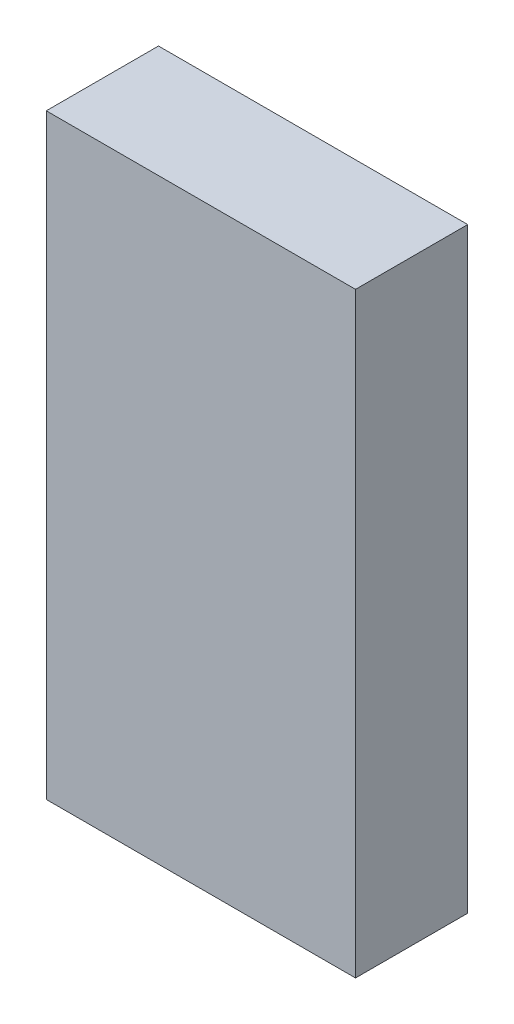
ISO-10303-21;
HEADER;
FILE_DESCRIPTION(('STEP AP214'),'2;1');
FILE_NAME('part.step','',(''),(''),'','','');
FILE_SCHEMA(('AUTOMOTIVE_DESIGN { 1 0 10303 214 1 1 1 1 }'));
ENDSEC;
DATA;
#1=APPLICATION_CONTEXT('core data for automotive mechanical design processes');
#2=APPLICATION_PROTOCOL_DEFINITION('international standard','automotive_design',2000,#1);
#3=PRODUCT_CONTEXT('',#1,'mechanical');
#4=PRODUCT('Part','Part','',(#3));
#5=PRODUCT_RELATED_PRODUCT_CATEGORY('part','',(#4));
#6=PRODUCT_DEFINITION_FORMATION('','',#4);
#7=PRODUCT_DEFINITION_CONTEXT('part definition',#1,'design');
#8=PRODUCT_DEFINITION('design','',#6,#7);
#9=PRODUCT_DEFINITION_SHAPE('','',#8);
#10=(LENGTH_UNIT() NAMED_UNIT(*) SI_UNIT(.MILLI.,.METRE.));
#11=(NAMED_UNIT(*) PLANE_ANGLE_UNIT() SI_UNIT($,.RADIAN.));
#12=(NAMED_UNIT(*) SI_UNIT($,.STERADIAN.) SOLID_ANGLE_UNIT());
#13=UNCERTAINTY_MEASURE_WITH_UNIT(LENGTH_MEASURE(1.E-05),#10,'distance_accuracy_value','');
#14=(GEOMETRIC_REPRESENTATION_CONTEXT(3) GLOBAL_UNCERTAINTY_ASSIGNED_CONTEXT((#13)) GLOBAL_UNIT_ASSIGNED_CONTEXT((#10,
#11,#12)) REPRESENTATION_CONTEXT('',''));
#15=CARTESIAN_POINT('',(0.,0.,0.));
#16=DIRECTION('',(0.,0.,1.));
#17=DIRECTION('',(1.,0.,0.));
#18=AXIS2_PLACEMENT_3D('',#15,#16,#17);
#19=CARTESIAN_POINT('',(0.3499993,0.67499992,0.));
#20=DIRECTION('',(0.,-1.,0.));
#21=DIRECTION('',(-1.,0.,0.));
#22=AXIS2_PLACEMENT_3D('',#19,#20,#21);
#23=PLANE('',#22);
#24=DIRECTION('',(-1.,0.,0.));
#25=VECTOR('',#24,1.);
#26=CARTESIAN_POINT('',(0.3499993,0.67499992,0.));
#27=LINE('',#26,#25);
#28=CARTESIAN_POINT('',(0.3499993,0.67499992,0.));
#29=VERTEX_POINT('',#28);
#30=CARTESIAN_POINT('',(-0.3499993,0.67499992,0.));
#31=VERTEX_POINT('',#30);
#32=EDGE_CURVE('E11',#29,#31,#27,.T.);
#33=ORIENTED_EDGE('',*,*,#32,.T.);
#34=DIRECTION('',(0.,0.,1.));
#35=VECTOR('',#34,1.);
#36=CARTESIAN_POINT('',(-0.3499993,0.67499992,0.));
#37=LINE('',#36,#35);
#38=CARTESIAN_POINT('',(-0.3499993,0.67499992,0.254));
#39=VERTEX_POINT('',#38);
#40=EDGE_CURVE('E24',#31,#39,#37,.T.);
#41=ORIENTED_EDGE('',*,*,#40,.T.);
#42=DIRECTION('',(-1.,0.,0.));
#43=VECTOR('',#42,1.);
#44=CARTESIAN_POINT('',(0.3499993,0.67499992,0.254));
#45=LINE('',#44,#43);
#46=CARTESIAN_POINT('',(0.3499993,0.67499992,0.254));
#47=VERTEX_POINT('',#46);
#48=EDGE_CURVE('E87',#47,#39,#45,.T.);
#49=ORIENTED_EDGE('',*,*,#48,.F.);
#50=DIRECTION('',(0.,0.,1.));
#51=VECTOR('',#50,1.);
#52=CARTESIAN_POINT('',(0.3499993,0.67499992,0.));
#53=LINE('',#52,#51);
#54=EDGE_CURVE('E36',#29,#47,#53,.T.);
#55=ORIENTED_EDGE('',*,*,#54,.F.);
#56=EDGE_LOOP('',(#33,#41,#49,#55));
#57=FACE_BOUND('',#56,.T.);
#58=ADVANCED_FACE('F17',(#57),#23,.F.);
#59=CARTESIAN_POINT('',(-0.3499993,0.67499992,0.));
#60=DIRECTION('',(1.,0.,0.));
#61=DIRECTION('',(0.,-1.,0.));
#62=AXIS2_PLACEMENT_3D('',#59,#60,#61);
#63=PLANE('',#62);
#64=DIRECTION('',(0.,-1.,0.));
#65=VECTOR('',#64,1.);
#66=CARTESIAN_POINT('',(-0.3499993,0.67499992,0.));
#67=LINE('',#66,#65);
#68=CARTESIAN_POINT('',(-0.3499993,-0.67499992,0.));
#69=VERTEX_POINT('',#68);
#70=EDGE_CURVE('E84',#31,#69,#67,.T.);
#71=ORIENTED_EDGE('',*,*,#70,.T.);
#72=DIRECTION('',(0.,0.,1.));
#73=VECTOR('',#72,1.);
#74=CARTESIAN_POINT('',(-0.3499993,-0.67499992,0.));
#75=LINE('',#74,#73);
#76=CARTESIAN_POINT('',(-0.3499993,-0.67499992,0.254));
#77=VERTEX_POINT('',#76);
#78=EDGE_CURVE('E82',#69,#77,#75,.T.);
#79=ORIENTED_EDGE('',*,*,#78,.T.);
#80=DIRECTION('',(0.,-1.,0.));
#81=VECTOR('',#80,1.);
#82=CARTESIAN_POINT('',(-0.3499993,0.67499992,0.254));
#83=LINE('',#82,#81);
#84=EDGE_CURVE('E62',#39,#77,#83,.T.);
#85=ORIENTED_EDGE('',*,*,#84,.F.);
#86=ORIENTED_EDGE('',*,*,#40,.F.);
#87=EDGE_LOOP('',(#71,#79,#85,#86));
#88=FACE_BOUND('',#87,.T.);
#89=ADVANCED_FACE('F89',(#88),#63,.F.);
#90=CARTESIAN_POINT('',(-0.3499993,-0.67499992,0.));
#91=DIRECTION('',(0.,1.,0.));
#92=DIRECTION('',(1.,0.,0.));
#93=AXIS2_PLACEMENT_3D('',#90,#91,#92);
#94=PLANE('',#93);
#95=DIRECTION('',(1.,0.,0.));
#96=VECTOR('',#95,1.);
#97=CARTESIAN_POINT('',(-0.3499993,-0.67499992,0.));
#98=LINE('',#97,#96);
#99=CARTESIAN_POINT('',(0.3499993,-0.67499992,0.));
#100=VERTEX_POINT('',#99);
#101=EDGE_CURVE('E71',#69,#100,#98,.T.);
#102=ORIENTED_EDGE('',*,*,#101,.T.);
#103=DIRECTION('',(0.,0.,1.));
#104=VECTOR('',#103,1.);
#105=CARTESIAN_POINT('',(0.3499993,-0.67499992,0.));
#106=LINE('',#105,#104);
#107=CARTESIAN_POINT('',(0.3499993,-0.67499992,0.254));
#108=VERTEX_POINT('',#107);
#109=EDGE_CURVE('E65',#100,#108,#106,.T.);
#110=ORIENTED_EDGE('',*,*,#109,.T.);
#111=DIRECTION('',(1.,0.,0.));
#112=VECTOR('',#111,1.);
#113=CARTESIAN_POINT('',(-0.3499993,-0.67499992,0.254));
#114=LINE('',#113,#112);
#115=EDGE_CURVE('E57',#77,#108,#114,.T.);
#116=ORIENTED_EDGE('',*,*,#115,.F.);
#117=ORIENTED_EDGE('',*,*,#78,.F.);
#118=EDGE_LOOP('',(#102,#110,#116,#117));
#119=FACE_BOUND('',#118,.T.);
#120=ADVANCED_FACE('F69',(#119),#94,.F.);
#121=CARTESIAN_POINT('',(0.3499993,-0.67499992,0.));
#122=DIRECTION('',(-1.,0.,0.));
#123=DIRECTION('',(0.,1.,0.));
#124=AXIS2_PLACEMENT_3D('',#121,#122,#123);
#125=PLANE('',#124);
#126=DIRECTION('',(0.,1.,0.));
#127=VECTOR('',#126,1.);
#128=CARTESIAN_POINT('',(0.3499993,-0.67499992,0.));
#129=LINE('',#128,#127);
#130=EDGE_CURVE('E66',#100,#29,#129,.T.);
#131=ORIENTED_EDGE('',*,*,#130,.T.);
#132=ORIENTED_EDGE('',*,*,#54,.T.);
#133=DIRECTION('',(0.,1.,0.));
#134=VECTOR('',#133,1.);
#135=CARTESIAN_POINT('',(0.3499993,-0.67499992,0.254));
#136=LINE('',#135,#134);
#137=EDGE_CURVE('E61',#108,#47,#136,.T.);
#138=ORIENTED_EDGE('',*,*,#137,.F.);
#139=ORIENTED_EDGE('',*,*,#109,.F.);
#140=EDGE_LOOP('',(#131,#132,#138,#139));
#141=FACE_BOUND('',#140,.T.);
#142=ADVANCED_FACE('F76',(#141),#125,.F.);
#143=CARTESIAN_POINT('',(0.3499993,0.67499992,0.));
#144=DIRECTION('',(0.,0.,-1.));
#145=DIRECTION('',(-1.,0.,0.));
#146=AXIS2_PLACEMENT_3D('',#143,#144,#145);
#147=PLANE('',#146);
#148=ORIENTED_EDGE('',*,*,#130,.F.);
#149=ORIENTED_EDGE('',*,*,#101,.F.);
#150=ORIENTED_EDGE('',*,*,#70,.F.);
#151=ORIENTED_EDGE('',*,*,#32,.F.);
#152=EDGE_LOOP('',(#148,#149,#150,#151));
#153=FACE_BOUND('',#152,.T.);
#154=ADVANCED_FACE('F91',(#153),#147,.T.);
#155=CARTESIAN_POINT('',(0.3499993,0.67499992,0.254));
#156=DIRECTION('',(0.,0.,-1.));
#157=DIRECTION('',(-1.,0.,0.));
#158=AXIS2_PLACEMENT_3D('',#155,#156,#157);
#159=PLANE('',#158);
#160=ORIENTED_EDGE('',*,*,#48,.T.);
#161=ORIENTED_EDGE('',*,*,#84,.T.);
#162=ORIENTED_EDGE('',*,*,#115,.T.);
#163=ORIENTED_EDGE('',*,*,#137,.T.);
#164=EDGE_LOOP('',(#160,#161,#162,#163));
#165=FACE_BOUND('',#164,.T.);
#166=ADVANCED_FACE('F59',(#165),#159,.F.);
#167=CLOSED_SHELL('',(#58,#89,#120,#142,#154,#166));
#168=MANIFOLD_SOLID_BREP('B1',#167);
#169=ADVANCED_BREP_SHAPE_REPRESENTATION('',(#18,#168),#14);
#170=SHAPE_DEFINITION_REPRESENTATION(#9,#169);
ENDSEC;
END-ISO-10303-21;
